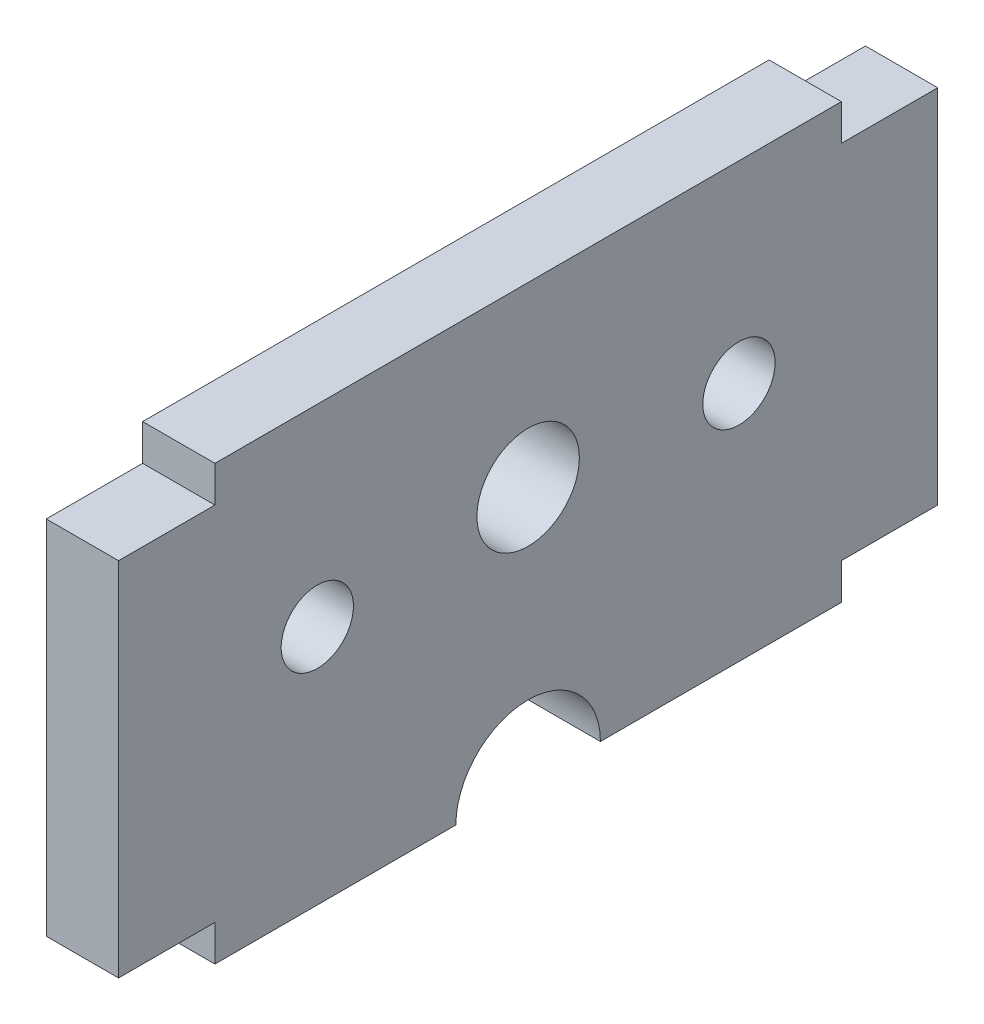
ISO-10303-21;
HEADER;
FILE_DESCRIPTION(('STEP AP214'),'2;1');
FILE_NAME('part.step','',(''),(''),'','','');
FILE_SCHEMA(('AUTOMOTIVE_DESIGN { 1 0 10303 214 1 1 1 1 }'));
ENDSEC;
DATA;
#1=APPLICATION_CONTEXT('core data for automotive mechanical design processes');
#2=APPLICATION_PROTOCOL_DEFINITION('international standard','automotive_design',2000,#1);
#3=PRODUCT_CONTEXT('',#1,'mechanical');
#4=PRODUCT('Part','Part','',(#3));
#5=PRODUCT_RELATED_PRODUCT_CATEGORY('part','',(#4));
#6=PRODUCT_DEFINITION_FORMATION('','',#4);
#7=PRODUCT_DEFINITION_CONTEXT('part definition',#1,'design');
#8=PRODUCT_DEFINITION('design','',#6,#7);
#9=PRODUCT_DEFINITION_SHAPE('','',#8);
#10=(LENGTH_UNIT() NAMED_UNIT(*) SI_UNIT(.MILLI.,.METRE.));
#11=(NAMED_UNIT(*) PLANE_ANGLE_UNIT() SI_UNIT($,.RADIAN.));
#12=(NAMED_UNIT(*) SI_UNIT($,.STERADIAN.) SOLID_ANGLE_UNIT());
#13=UNCERTAINTY_MEASURE_WITH_UNIT(LENGTH_MEASURE(1.E-05),#10,'distance_accuracy_value','');
#14=(GEOMETRIC_REPRESENTATION_CONTEXT(3) GLOBAL_UNCERTAINTY_ASSIGNED_CONTEXT((#13)) GLOBAL_UNIT_ASSIGNED_CONTEXT((#10,
#11,#12)) REPRESENTATION_CONTEXT('',''));
#15=CARTESIAN_POINT('',(0.,0.,0.));
#16=DIRECTION('',(0.,0.,1.));
#17=DIRECTION('',(1.,0.,0.));
#18=AXIS2_PLACEMENT_3D('',#15,#16,#17);
#19=CARTESIAN_POINT('',(3.,-10.,13.));
#20=DIRECTION('',(0.,1.,0.));
#21=DIRECTION('',(0.,0.,1.));
#22=AXIS2_PLACEMENT_3D('',#19,#20,#21);
#23=PLANE('',#22);
#24=DIRECTION('',(0.,0.,-1.));
#25=VECTOR('',#24,1.);
#26=CARTESIAN_POINT('',(0.,-10.,13.));
#27=LINE('',#26,#25);
#28=CARTESIAN_POINT('',(0.,-10.,13.));
#29=VERTEX_POINT('',#28);
#30=CARTESIAN_POINT('',(0.,-10.,3.));
#31=VERTEX_POINT('',#30);
#32=EDGE_CURVE('E173',#29,#31,#27,.T.);
#33=ORIENTED_EDGE('',*,*,#32,.T.);
#34=DIRECTION('',(1.,0.,0.));
#35=VECTOR('',#34,1.);
#36=CARTESIAN_POINT('',(0.,-10.,3.));
#37=LINE('',#36,#35);
#38=CARTESIAN_POINT('',(3.,-10.,3.));
#39=VERTEX_POINT('',#38);
#40=EDGE_CURVE('E281',#31,#39,#37,.T.);
#41=ORIENTED_EDGE('',*,*,#40,.T.);
#42=DIRECTION('',(0.,0.,-1.));
#43=VECTOR('',#42,1.);
#44=CARTESIAN_POINT('',(3.,-10.,13.));
#45=LINE('',#44,#43);
#46=CARTESIAN_POINT('',(3.,-10.,13.));
#47=VERTEX_POINT('',#46);
#48=EDGE_CURVE('E110',#47,#39,#45,.T.);
#49=ORIENTED_EDGE('',*,*,#48,.F.);
#50=DIRECTION('',(-1.,0.,0.));
#51=VECTOR('',#50,1.);
#52=CARTESIAN_POINT('',(3.,-10.,13.));
#53=LINE('',#52,#51);
#54=EDGE_CURVE('E11',#47,#29,#53,.T.);
#55=ORIENTED_EDGE('',*,*,#54,.T.);
#56=EDGE_LOOP('',(#33,#41,#49,#55));
#57=FACE_BOUND('',#56,.T.);
#58=ADVANCED_FACE('F33',(#57),#23,.F.);
#59=CARTESIAN_POINT('',(3.,0.,0.));
#60=DIRECTION('',(-1.,0.,0.));
#61=DIRECTION('',(0.,0.,1.));
#62=AXIS2_PLACEMENT_3D('',#59,#60,#61);
#63=PLANE('',#62);
#64=CARTESIAN_POINT('',(3.,0.641129032258075,0.));
#65=DIRECTION('',(1.,0.,0.));
#66=DIRECTION('',(0.,0.,-1.));
#67=AXIS2_PLACEMENT_3D('',#64,#65,#66);
#68=CIRCLE('',#67,2.125);
#69=CARTESIAN_POINT('',(3.,0.641129032258075,-2.125));
#70=VERTEX_POINT('',#69);
#71=EDGE_CURVE('E427',#70,#70,#68,.T.);
#72=ORIENTED_EDGE('',*,*,#71,.F.);
#73=EDGE_LOOP('',(#72));
#74=FACE_BOUND('',#73,.T.);
#75=ORIENTED_EDGE('',*,*,#48,.T.);
#76=CARTESIAN_POINT('',(3.,-10.,0.));
#77=DIRECTION('',(1.,0.,0.));
#78=DIRECTION('',(0.,0.,-1.));
#79=AXIS2_PLACEMENT_3D('',#76,#77,#78);
#80=CIRCLE('',#79,3.);
#81=CARTESIAN_POINT('',(3.,-10.,-3.));
#82=VERTEX_POINT('',#81);
#83=EDGE_CURVE('E275',#82,#39,#80,.T.);
#84=ORIENTED_EDGE('',*,*,#83,.F.);
#85=CARTESIAN_POINT('',(3.,-10.,-13.));
#86=VERTEX_POINT('',#85);
#87=EDGE_CURVE('E267',#82,#86,#45,.T.);
#88=ORIENTED_EDGE('',*,*,#87,.T.);
#89=DIRECTION('',(0.,1.,0.));
#90=VECTOR('',#89,1.);
#91=CARTESIAN_POINT('',(3.,-10.,-13.));
#92=LINE('',#91,#90);
#93=CARTESIAN_POINT('',(3.,-8.5,-13.));
#94=VERTEX_POINT('',#93);
#95=EDGE_CURVE('E222',#86,#94,#92,.T.);
#96=ORIENTED_EDGE('',*,*,#95,.T.);
#97=DIRECTION('',(0.,0.,-1.));
#98=VECTOR('',#97,1.);
#99=CARTESIAN_POINT('',(3.,-8.5,-17.));
#100=LINE('',#99,#98);
#101=CARTESIAN_POINT('',(3.,-8.5,-17.));
#102=VERTEX_POINT('',#101);
#103=EDGE_CURVE('E243',#94,#102,#100,.T.);
#104=ORIENTED_EDGE('',*,*,#103,.T.);
#105=DIRECTION('',(0.,1.,0.));
#106=VECTOR('',#105,1.);
#107=CARTESIAN_POINT('',(3.,6.5,-17.));
#108=LINE('',#107,#106);
#109=CARTESIAN_POINT('',(3.,6.5,-17.));
#110=VERTEX_POINT('',#109);
#111=EDGE_CURVE('E240',#102,#110,#108,.T.);
#112=ORIENTED_EDGE('',*,*,#111,.T.);
#113=DIRECTION('',(0.,0.,1.));
#114=VECTOR('',#113,1.);
#115=CARTESIAN_POINT('',(3.,6.5,-13.));
#116=LINE('',#115,#114);
#117=CARTESIAN_POINT('',(3.,6.5,-13.));
#118=VERTEX_POINT('',#117);
#119=EDGE_CURVE('E242',#110,#118,#116,.T.);
#120=ORIENTED_EDGE('',*,*,#119,.T.);
#121=DIRECTION('',(0.,1.,0.));
#122=VECTOR('',#121,1.);
#123=CARTESIAN_POINT('',(3.,6.5,-13.));
#124=LINE('',#123,#122);
#125=CARTESIAN_POINT('',(3.,8.,-13.));
#126=VERTEX_POINT('',#125);
#127=EDGE_CURVE('E245',#118,#126,#124,.T.);
#128=ORIENTED_EDGE('',*,*,#127,.T.);
#129=DIRECTION('',(0.,0.,1.));
#130=VECTOR('',#129,1.);
#131=CARTESIAN_POINT('',(3.,8.,13.));
#132=LINE('',#131,#130);
#133=CARTESIAN_POINT('',(3.,8.,13.));
#134=VERTEX_POINT('',#133);
#135=EDGE_CURVE('E251',#126,#134,#132,.T.);
#136=ORIENTED_EDGE('',*,*,#135,.T.);
#137=DIRECTION('',(0.,-1.,0.));
#138=VECTOR('',#137,1.);
#139=CARTESIAN_POINT('',(3.,6.5,13.));
#140=LINE('',#139,#138);
#141=CARTESIAN_POINT('',(3.,6.5,13.));
#142=VERTEX_POINT('',#141);
#143=EDGE_CURVE('E147',#134,#142,#140,.T.);
#144=ORIENTED_EDGE('',*,*,#143,.T.);
#145=DIRECTION('',(0.,0.,1.));
#146=VECTOR('',#145,1.);
#147=CARTESIAN_POINT('',(3.,6.5,13.));
#148=LINE('',#147,#146);
#149=CARTESIAN_POINT('',(3.,6.5,17.));
#150=VERTEX_POINT('',#149);
#151=EDGE_CURVE('E139',#142,#150,#148,.T.);
#152=ORIENTED_EDGE('',*,*,#151,.T.);
#153=DIRECTION('',(0.,-1.,0.));
#154=VECTOR('',#153,1.);
#155=CARTESIAN_POINT('',(3.,6.5,17.));
#156=LINE('',#155,#154);
#157=CARTESIAN_POINT('',(3.,-8.5,17.));
#158=VERTEX_POINT('',#157);
#159=EDGE_CURVE('E144',#150,#158,#156,.T.);
#160=ORIENTED_EDGE('',*,*,#159,.T.);
#161=DIRECTION('',(0.,0.,-1.));
#162=VECTOR('',#161,1.);
#163=CARTESIAN_POINT('',(3.,-8.5,17.));
#164=LINE('',#163,#162);
#165=CARTESIAN_POINT('',(3.,-8.5,13.));
#166=VERTEX_POINT('',#165);
#167=EDGE_CURVE('E57',#158,#166,#164,.T.);
#168=ORIENTED_EDGE('',*,*,#167,.T.);
#169=DIRECTION('',(0.,-1.,0.));
#170=VECTOR('',#169,1.);
#171=CARTESIAN_POINT('',(3.,-10.,13.));
#172=LINE('',#171,#170);
#173=EDGE_CURVE('E194',#166,#47,#172,.T.);
#174=ORIENTED_EDGE('',*,*,#173,.T.);
#175=EDGE_LOOP('',(#75,#84,#88,#96,#104,#112,#120,#128,#136,#144,#152,#160,#168,#174));
#176=FACE_BOUND('',#175,.T.);
#177=CARTESIAN_POINT('',(3.,0.,8.75));
#178=DIRECTION('',(1.,0.,0.));
#179=DIRECTION('',(0.,0.,-1.));
#180=AXIS2_PLACEMENT_3D('',#177,#178,#179);
#181=CIRCLE('',#180,1.5);
#182=CARTESIAN_POINT('',(3.,0.,7.25));
#183=VERTEX_POINT('',#182);
#184=EDGE_CURVE('E172',#183,#183,#181,.T.);
#185=ORIENTED_EDGE('',*,*,#184,.F.);
#186=EDGE_LOOP('',(#185));
#187=FACE_BOUND('',#186,.T.);
#188=CARTESIAN_POINT('',(3.,0.,-8.75));
#189=DIRECTION('',(1.,0.,0.));
#190=DIRECTION('',(0.,0.,-1.));
#191=AXIS2_PLACEMENT_3D('',#188,#189,#190);
#192=CIRCLE('',#191,1.5);
#193=CARTESIAN_POINT('',(3.,0.,-10.25));
#194=VERTEX_POINT('',#193);
#195=EDGE_CURVE('E289',#194,#194,#192,.T.);
#196=ORIENTED_EDGE('',*,*,#195,.F.);
#197=EDGE_LOOP('',(#196));
#198=FACE_BOUND('',#197,.T.);
#199=ADVANCED_FACE('F141',(#74,#176,#187,#198),#63,.F.);
#200=CARTESIAN_POINT('',(0.,0.,0.));
#201=DIRECTION('',(-1.,0.,0.));
#202=DIRECTION('',(0.,0.,1.));
#203=AXIS2_PLACEMENT_3D('',#200,#201,#202);
#204=PLANE('',#203);
#205=CARTESIAN_POINT('',(0.,0.641129032258075,0.));
#206=DIRECTION('',(1.,0.,0.));
#207=DIRECTION('',(0.,0.,-1.));
#208=AXIS2_PLACEMENT_3D('',#205,#206,#207);
#209=CIRCLE('',#208,2.125);
#210=CARTESIAN_POINT('',(0.,0.641129032258075,-2.125));
#211=VERTEX_POINT('',#210);
#212=EDGE_CURVE('E282',#211,#211,#209,.T.);
#213=ORIENTED_EDGE('',*,*,#212,.T.);
#214=EDGE_LOOP('',(#213));
#215=FACE_BOUND('',#214,.T.);
#216=CARTESIAN_POINT('',(0.,-10.,0.));
#217=DIRECTION('',(1.,0.,0.));
#218=DIRECTION('',(0.,0.,-1.));
#219=AXIS2_PLACEMENT_3D('',#216,#217,#218);
#220=CIRCLE('',#219,3.);
#221=CARTESIAN_POINT('',(0.,-10.,-3.));
#222=VERTEX_POINT('',#221);
#223=EDGE_CURVE('E48',#222,#31,#220,.T.);
#224=ORIENTED_EDGE('',*,*,#223,.T.);
#225=ORIENTED_EDGE('',*,*,#32,.F.);
#226=DIRECTION('',(0.,-1.,0.));
#227=VECTOR('',#226,1.);
#228=CARTESIAN_POINT('',(0.,-10.,13.));
#229=LINE('',#228,#227);
#230=CARTESIAN_POINT('',(0.,-8.5,13.));
#231=VERTEX_POINT('',#230);
#232=EDGE_CURVE('E168',#231,#29,#229,.T.);
#233=ORIENTED_EDGE('',*,*,#232,.F.);
#234=DIRECTION('',(0.,0.,-1.));
#235=VECTOR('',#234,1.);
#236=CARTESIAN_POINT('',(0.,-8.5,17.));
#237=LINE('',#236,#235);
#238=CARTESIAN_POINT('',(0.,-8.5,17.));
#239=VERTEX_POINT('',#238);
#240=EDGE_CURVE('E102',#239,#231,#237,.T.);
#241=ORIENTED_EDGE('',*,*,#240,.F.);
#242=DIRECTION('',(0.,-1.,0.));
#243=VECTOR('',#242,1.);
#244=CARTESIAN_POINT('',(0.,6.5,17.));
#245=LINE('',#244,#243);
#246=CARTESIAN_POINT('',(0.,6.5,17.));
#247=VERTEX_POINT('',#246);
#248=EDGE_CURVE('E191',#247,#239,#245,.T.);
#249=ORIENTED_EDGE('',*,*,#248,.F.);
#250=DIRECTION('',(0.,0.,1.));
#251=VECTOR('',#250,1.);
#252=CARTESIAN_POINT('',(0.,6.5,13.));
#253=LINE('',#252,#251);
#254=CARTESIAN_POINT('',(0.,6.5,13.));
#255=VERTEX_POINT('',#254);
#256=EDGE_CURVE('E156',#255,#247,#253,.T.);
#257=ORIENTED_EDGE('',*,*,#256,.F.);
#258=DIRECTION('',(0.,-1.,0.));
#259=VECTOR('',#258,1.);
#260=CARTESIAN_POINT('',(0.,6.5,13.));
#261=LINE('',#260,#259);
#262=CARTESIAN_POINT('',(0.,8.,13.));
#263=VERTEX_POINT('',#262);
#264=EDGE_CURVE('E188',#263,#255,#261,.T.);
#265=ORIENTED_EDGE('',*,*,#264,.F.);
#266=DIRECTION('',(0.,0.,1.));
#267=VECTOR('',#266,1.);
#268=CARTESIAN_POINT('',(0.,8.,13.));
#269=LINE('',#268,#267);
#270=CARTESIAN_POINT('',(0.,8.,-13.));
#271=VERTEX_POINT('',#270);
#272=EDGE_CURVE('E186',#271,#263,#269,.T.);
#273=ORIENTED_EDGE('',*,*,#272,.F.);
#274=DIRECTION('',(0.,1.,0.));
#275=VECTOR('',#274,1.);
#276=CARTESIAN_POINT('',(0.,6.5,-13.));
#277=LINE('',#276,#275);
#278=CARTESIAN_POINT('',(0.,6.5,-13.));
#279=VERTEX_POINT('',#278);
#280=EDGE_CURVE('E184',#279,#271,#277,.T.);
#281=ORIENTED_EDGE('',*,*,#280,.F.);
#282=DIRECTION('',(0.,0.,1.));
#283=VECTOR('',#282,1.);
#284=CARTESIAN_POINT('',(0.,6.5,-13.));
#285=LINE('',#284,#283);
#286=CARTESIAN_POINT('',(0.,6.5,-17.));
#287=VERTEX_POINT('',#286);
#288=EDGE_CURVE('E182',#287,#279,#285,.T.);
#289=ORIENTED_EDGE('',*,*,#288,.F.);
#290=DIRECTION('',(0.,1.,0.));
#291=VECTOR('',#290,1.);
#292=CARTESIAN_POINT('',(0.,6.5,-17.));
#293=LINE('',#292,#291);
#294=CARTESIAN_POINT('',(0.,-8.5,-17.));
#295=VERTEX_POINT('',#294);
#296=EDGE_CURVE('E180',#295,#287,#293,.T.);
#297=ORIENTED_EDGE('',*,*,#296,.F.);
#298=DIRECTION('',(0.,0.,-1.));
#299=VECTOR('',#298,1.);
#300=CARTESIAN_POINT('',(0.,-8.5,-17.));
#301=LINE('',#300,#299);
#302=CARTESIAN_POINT('',(0.,-8.5,-13.));
#303=VERTEX_POINT('',#302);
#304=EDGE_CURVE('E178',#303,#295,#301,.T.);
#305=ORIENTED_EDGE('',*,*,#304,.F.);
#306=DIRECTION('',(0.,1.,0.));
#307=VECTOR('',#306,1.);
#308=CARTESIAN_POINT('',(0.,-10.,-13.));
#309=LINE('',#308,#307);
#310=CARTESIAN_POINT('',(0.,-10.,-13.));
#311=VERTEX_POINT('',#310);
#312=EDGE_CURVE('E176',#311,#303,#309,.T.);
#313=ORIENTED_EDGE('',*,*,#312,.F.);
#314=EDGE_CURVE('E171',#222,#311,#27,.T.);
#315=ORIENTED_EDGE('',*,*,#314,.F.);
#316=EDGE_LOOP('',(#224,#225,#233,#241,#249,#257,#265,#273,#281,#289,#297,#305,#313,#315));
#317=FACE_BOUND('',#316,.T.);
#318=CARTESIAN_POINT('',(0.,0.,8.75));
#319=DIRECTION('',(1.,0.,0.));
#320=DIRECTION('',(0.,0.,-1.));
#321=AXIS2_PLACEMENT_3D('',#318,#319,#320);
#322=CIRCLE('',#321,1.5);
#323=CARTESIAN_POINT('',(0.,0.,7.25));
#324=VERTEX_POINT('',#323);
#325=EDGE_CURVE('E271',#324,#324,#322,.T.);
#326=ORIENTED_EDGE('',*,*,#325,.T.);
#327=EDGE_LOOP('',(#326));
#328=FACE_BOUND('',#327,.T.);
#329=CARTESIAN_POINT('',(0.,0.,-8.75));
#330=DIRECTION('',(1.,0.,0.));
#331=DIRECTION('',(0.,0.,-1.));
#332=AXIS2_PLACEMENT_3D('',#329,#330,#331);
#333=CIRCLE('',#332,1.5);
#334=CARTESIAN_POINT('',(0.,0.,-10.25));
#335=VERTEX_POINT('',#334);
#336=EDGE_CURVE('E285',#335,#335,#333,.T.);
#337=ORIENTED_EDGE('',*,*,#336,.T.);
#338=EDGE_LOOP('',(#337));
#339=FACE_BOUND('',#338,.T.);
#340=ADVANCED_FACE('F228',(#215,#317,#328,#339),#204,.T.);
#341=CARTESIAN_POINT('',(3.,-10.,13.));
#342=DIRECTION('',(0.,0.,-1.));
#343=DIRECTION('',(-1.,0.,0.));
#344=AXIS2_PLACEMENT_3D('',#341,#342,#343);
#345=PLANE('',#344);
#346=ORIENTED_EDGE('',*,*,#232,.T.);
#347=ORIENTED_EDGE('',*,*,#54,.F.);
#348=ORIENTED_EDGE('',*,*,#173,.F.);
#349=DIRECTION('',(-1.,0.,0.));
#350=VECTOR('',#349,1.);
#351=CARTESIAN_POINT('',(3.,-8.5,13.));
#352=LINE('',#351,#350);
#353=EDGE_CURVE('E164',#166,#231,#352,.T.);
#354=ORIENTED_EDGE('',*,*,#353,.T.);
#355=EDGE_LOOP('',(#346,#347,#348,#354));
#356=FACE_BOUND('',#355,.T.);
#357=ADVANCED_FACE('F35',(#356),#345,.F.);
#358=ORIENTED_EDGE('',*,*,#87,.F.);
#359=DIRECTION('',(1.,0.,0.));
#360=VECTOR('',#359,1.);
#361=CARTESIAN_POINT('',(0.,-10.,-3.));
#362=LINE('',#361,#360);
#363=EDGE_CURVE('E277',#222,#82,#362,.T.);
#364=ORIENTED_EDGE('',*,*,#363,.F.);
#365=ORIENTED_EDGE('',*,*,#314,.T.);
#366=DIRECTION('',(-1.,0.,0.));
#367=VECTOR('',#366,1.);
#368=CARTESIAN_POINT('',(3.,-10.,-13.));
#369=LINE('',#368,#367);
#370=EDGE_CURVE('E41',#86,#311,#369,.T.);
#371=ORIENTED_EDGE('',*,*,#370,.F.);
#372=EDGE_LOOP('',(#358,#364,#365,#371));
#373=FACE_BOUND('',#372,.T.);
#374=ADVANCED_FACE('F276',(#373),#23,.F.);
#375=CARTESIAN_POINT('',(3.,-10.,-13.));
#376=DIRECTION('',(0.,0.,1.));
#377=DIRECTION('',(0.,-1.,0.));
#378=AXIS2_PLACEMENT_3D('',#375,#376,#377);
#379=PLANE('',#378);
#380=ORIENTED_EDGE('',*,*,#312,.T.);
#381=DIRECTION('',(-1.,0.,0.));
#382=VECTOR('',#381,1.);
#383=CARTESIAN_POINT('',(3.,-8.5,-13.));
#384=LINE('',#383,#382);
#385=EDGE_CURVE('E213',#94,#303,#384,.T.);
#386=ORIENTED_EDGE('',*,*,#385,.F.);
#387=ORIENTED_EDGE('',*,*,#95,.F.);
#388=ORIENTED_EDGE('',*,*,#370,.T.);
#389=EDGE_LOOP('',(#380,#386,#387,#388));
#390=FACE_BOUND('',#389,.T.);
#391=ADVANCED_FACE('F220',(#390),#379,.F.);
#392=CARTESIAN_POINT('',(3.,-8.5,-17.));
#393=DIRECTION('',(0.,1.,0.));
#394=DIRECTION('',(0.,0.,1.));
#395=AXIS2_PLACEMENT_3D('',#392,#393,#394);
#396=PLANE('',#395);
#397=ORIENTED_EDGE('',*,*,#304,.T.);
#398=DIRECTION('',(-1.,0.,0.));
#399=VECTOR('',#398,1.);
#400=CARTESIAN_POINT('',(3.,-8.5,-17.));
#401=LINE('',#400,#399);
#402=EDGE_CURVE('E210',#102,#295,#401,.T.);
#403=ORIENTED_EDGE('',*,*,#402,.F.);
#404=ORIENTED_EDGE('',*,*,#103,.F.);
#405=ORIENTED_EDGE('',*,*,#385,.T.);
#406=EDGE_LOOP('',(#397,#403,#404,#405));
#407=FACE_BOUND('',#406,.T.);
#408=ADVANCED_FACE('F234',(#407),#396,.F.);
#409=CARTESIAN_POINT('',(3.,6.5,-17.));
#410=DIRECTION('',(0.,0.,1.));
#411=DIRECTION('',(1.,0.,0.));
#412=AXIS2_PLACEMENT_3D('',#409,#410,#411);
#413=PLANE('',#412);
#414=ORIENTED_EDGE('',*,*,#296,.T.);
#415=DIRECTION('',(-1.,0.,0.));
#416=VECTOR('',#415,1.);
#417=CARTESIAN_POINT('',(3.,6.5,-17.));
#418=LINE('',#417,#416);
#419=EDGE_CURVE('E207',#110,#287,#418,.T.);
#420=ORIENTED_EDGE('',*,*,#419,.F.);
#421=ORIENTED_EDGE('',*,*,#111,.F.);
#422=ORIENTED_EDGE('',*,*,#402,.T.);
#423=EDGE_LOOP('',(#414,#420,#421,#422));
#424=FACE_BOUND('',#423,.T.);
#425=ADVANCED_FACE('F238',(#424),#413,.F.);
#426=CARTESIAN_POINT('',(3.,6.5,-13.));
#427=DIRECTION('',(0.,-1.,0.));
#428=DIRECTION('',(0.,0.,-1.));
#429=AXIS2_PLACEMENT_3D('',#426,#427,#428);
#430=PLANE('',#429);
#431=ORIENTED_EDGE('',*,*,#288,.T.);
#432=DIRECTION('',(-1.,0.,0.));
#433=VECTOR('',#432,1.);
#434=CARTESIAN_POINT('',(3.,6.5,-13.));
#435=LINE('',#434,#433);
#436=EDGE_CURVE('E204',#118,#279,#435,.T.);
#437=ORIENTED_EDGE('',*,*,#436,.F.);
#438=ORIENTED_EDGE('',*,*,#119,.F.);
#439=ORIENTED_EDGE('',*,*,#419,.T.);
#440=EDGE_LOOP('',(#431,#437,#438,#439));
#441=FACE_BOUND('',#440,.T.);
#442=ADVANCED_FACE('F346',(#441),#430,.F.);
#443=CARTESIAN_POINT('',(3.,6.5,-13.));
#444=DIRECTION('',(0.,0.,1.));
#445=DIRECTION('',(0.,-1.,0.));
#446=AXIS2_PLACEMENT_3D('',#443,#444,#445);
#447=PLANE('',#446);
#448=ORIENTED_EDGE('',*,*,#280,.T.);
#449=DIRECTION('',(-1.,0.,0.));
#450=VECTOR('',#449,1.);
#451=CARTESIAN_POINT('',(3.,8.,-13.));
#452=LINE('',#451,#450);
#453=EDGE_CURVE('E201',#126,#271,#452,.T.);
#454=ORIENTED_EDGE('',*,*,#453,.F.);
#455=ORIENTED_EDGE('',*,*,#127,.F.);
#456=ORIENTED_EDGE('',*,*,#436,.T.);
#457=EDGE_LOOP('',(#448,#454,#455,#456));
#458=FACE_BOUND('',#457,.T.);
#459=ADVANCED_FACE('F343',(#458),#447,.F.);
#460=CARTESIAN_POINT('',(3.,8.,13.));
#461=DIRECTION('',(0.,-1.,0.));
#462=DIRECTION('',(0.,0.,-1.));
#463=AXIS2_PLACEMENT_3D('',#460,#461,#462);
#464=PLANE('',#463);
#465=ORIENTED_EDGE('',*,*,#272,.T.);
#466=DIRECTION('',(-1.,0.,0.));
#467=VECTOR('',#466,1.);
#468=CARTESIAN_POINT('',(3.,8.,13.));
#469=LINE('',#468,#467);
#470=EDGE_CURVE('E198',#134,#263,#469,.T.);
#471=ORIENTED_EDGE('',*,*,#470,.F.);
#472=ORIENTED_EDGE('',*,*,#135,.F.);
#473=ORIENTED_EDGE('',*,*,#453,.T.);
#474=EDGE_LOOP('',(#465,#471,#472,#473));
#475=FACE_BOUND('',#474,.T.);
#476=ADVANCED_FACE('F257',(#475),#464,.F.);
#477=CARTESIAN_POINT('',(3.,6.5,13.));
#478=DIRECTION('',(0.,0.,-1.));
#479=DIRECTION('',(-1.,0.,0.));
#480=AXIS2_PLACEMENT_3D('',#477,#478,#479);
#481=PLANE('',#480);
#482=ORIENTED_EDGE('',*,*,#264,.T.);
#483=DIRECTION('',(-1.,0.,0.));
#484=VECTOR('',#483,1.);
#485=CARTESIAN_POINT('',(3.,6.5,13.));
#486=LINE('',#485,#484);
#487=EDGE_CURVE('E159',#142,#255,#486,.T.);
#488=ORIENTED_EDGE('',*,*,#487,.F.);
#489=ORIENTED_EDGE('',*,*,#143,.F.);
#490=ORIENTED_EDGE('',*,*,#470,.T.);
#491=EDGE_LOOP('',(#482,#488,#489,#490));
#492=FACE_BOUND('',#491,.T.);
#493=ADVANCED_FACE('F261',(#492),#481,.F.);
#494=CARTESIAN_POINT('',(3.,6.5,13.));
#495=DIRECTION('',(0.,-1.,0.));
#496=DIRECTION('',(0.,0.,-1.));
#497=AXIS2_PLACEMENT_3D('',#494,#495,#496);
#498=PLANE('',#497);
#499=ORIENTED_EDGE('',*,*,#256,.T.);
#500=DIRECTION('',(-1.,0.,0.));
#501=VECTOR('',#500,1.);
#502=CARTESIAN_POINT('',(3.,6.5,17.));
#503=LINE('',#502,#501);
#504=EDGE_CURVE('E153',#150,#247,#503,.T.);
#505=ORIENTED_EDGE('',*,*,#504,.F.);
#506=ORIENTED_EDGE('',*,*,#151,.F.);
#507=ORIENTED_EDGE('',*,*,#487,.T.);
#508=EDGE_LOOP('',(#499,#505,#506,#507));
#509=FACE_BOUND('',#508,.T.);
#510=ADVANCED_FACE('F154',(#509),#498,.F.);
#511=CARTESIAN_POINT('',(3.,6.5,17.));
#512=DIRECTION('',(0.,0.,-1.));
#513=DIRECTION('',(-1.,0.,0.));
#514=AXIS2_PLACEMENT_3D('',#511,#512,#513);
#515=PLANE('',#514);
#516=ORIENTED_EDGE('',*,*,#248,.T.);
#517=DIRECTION('',(-1.,0.,0.));
#518=VECTOR('',#517,1.);
#519=CARTESIAN_POINT('',(3.,-8.5,17.));
#520=LINE('',#519,#518);
#521=EDGE_CURVE('E160',#158,#239,#520,.T.);
#522=ORIENTED_EDGE('',*,*,#521,.F.);
#523=ORIENTED_EDGE('',*,*,#159,.F.);
#524=ORIENTED_EDGE('',*,*,#504,.T.);
#525=EDGE_LOOP('',(#516,#522,#523,#524));
#526=FACE_BOUND('',#525,.T.);
#527=ADVANCED_FACE('F162',(#526),#515,.F.);
#528=CARTESIAN_POINT('',(3.,-8.5,17.));
#529=DIRECTION('',(0.,1.,0.));
#530=DIRECTION('',(0.,0.,1.));
#531=AXIS2_PLACEMENT_3D('',#528,#529,#530);
#532=PLANE('',#531);
#533=ORIENTED_EDGE('',*,*,#240,.T.);
#534=ORIENTED_EDGE('',*,*,#353,.F.);
#535=ORIENTED_EDGE('',*,*,#167,.F.);
#536=ORIENTED_EDGE('',*,*,#521,.T.);
#537=EDGE_LOOP('',(#533,#534,#535,#536));
#538=FACE_BOUND('',#537,.T.);
#539=ADVANCED_FACE('F263',(#538),#532,.F.);
#540=CARTESIAN_POINT('',(3.,0.,8.75));
#541=DIRECTION('',(-1.,0.,0.));
#542=DIRECTION('',(0.,0.,1.));
#543=AXIS2_PLACEMENT_3D('',#540,#541,#542);
#544=CYLINDRICAL_SURFACE('',#543,1.5);
#545=ORIENTED_EDGE('',*,*,#184,.T.);
#546=EDGE_LOOP('',(#545));
#547=FACE_BOUND('',#546,.T.);
#548=ORIENTED_EDGE('',*,*,#325,.F.);
#549=EDGE_LOOP('',(#548));
#550=FACE_BOUND('',#549,.T.);
#551=ADVANCED_FACE('F300',(#547,#550),#544,.F.);
#552=CARTESIAN_POINT('',(3.,0.,-8.75));
#553=DIRECTION('',(-1.,0.,0.));
#554=DIRECTION('',(0.,0.,1.));
#555=AXIS2_PLACEMENT_3D('',#552,#553,#554);
#556=CYLINDRICAL_SURFACE('',#555,1.5);
#557=ORIENTED_EDGE('',*,*,#195,.T.);
#558=EDGE_LOOP('',(#557));
#559=FACE_BOUND('',#558,.T.);
#560=ORIENTED_EDGE('',*,*,#336,.F.);
#561=EDGE_LOOP('',(#560));
#562=FACE_BOUND('',#561,.T.);
#563=ADVANCED_FACE('F302',(#559,#562),#556,.F.);
#564=CARTESIAN_POINT('',(0.,-10.,0.));
#565=DIRECTION('',(1.,0.,0.));
#566=DIRECTION('',(0.,0.,-1.));
#567=AXIS2_PLACEMENT_3D('',#564,#565,#566);
#568=CYLINDRICAL_SURFACE('',#567,3.);
#569=ORIENTED_EDGE('',*,*,#83,.T.);
#570=ORIENTED_EDGE('',*,*,#40,.F.);
#571=ORIENTED_EDGE('',*,*,#223,.F.);
#572=ORIENTED_EDGE('',*,*,#363,.T.);
#573=EDGE_LOOP('',(#569,#570,#571,#572));
#574=FACE_BOUND('',#573,.T.);
#575=ADVANCED_FACE('F280',(#574),#568,.F.);
#576=CARTESIAN_POINT('',(0.,0.641129032258075,0.));
#577=DIRECTION('',(1.,0.,0.));
#578=DIRECTION('',(0.,0.,-1.));
#579=AXIS2_PLACEMENT_3D('',#576,#577,#578);
#580=CYLINDRICAL_SURFACE('',#579,2.125);
#581=ORIENTED_EDGE('',*,*,#212,.F.);
#582=EDGE_LOOP('',(#581));
#583=FACE_BOUND('',#582,.T.);
#584=ORIENTED_EDGE('',*,*,#71,.T.);
#585=EDGE_LOOP('',(#584));
#586=FACE_BOUND('',#585,.T.);
#587=ADVANCED_FACE('F411',(#583,#586),#580,.F.);
#588=CLOSED_SHELL('',(#58,#199,#340,#357,#374,#391,#408,#425,#442,#459,#476,#493,#510,#527,#539,
#551,#563,#575,#587));
#589=MANIFOLD_SOLID_BREP('B2',#588);
#590=ADVANCED_BREP_SHAPE_REPRESENTATION('',(#18,#589),#14);
#591=SHAPE_DEFINITION_REPRESENTATION(#9,#590);
ENDSEC;
END-ISO-10303-21;
